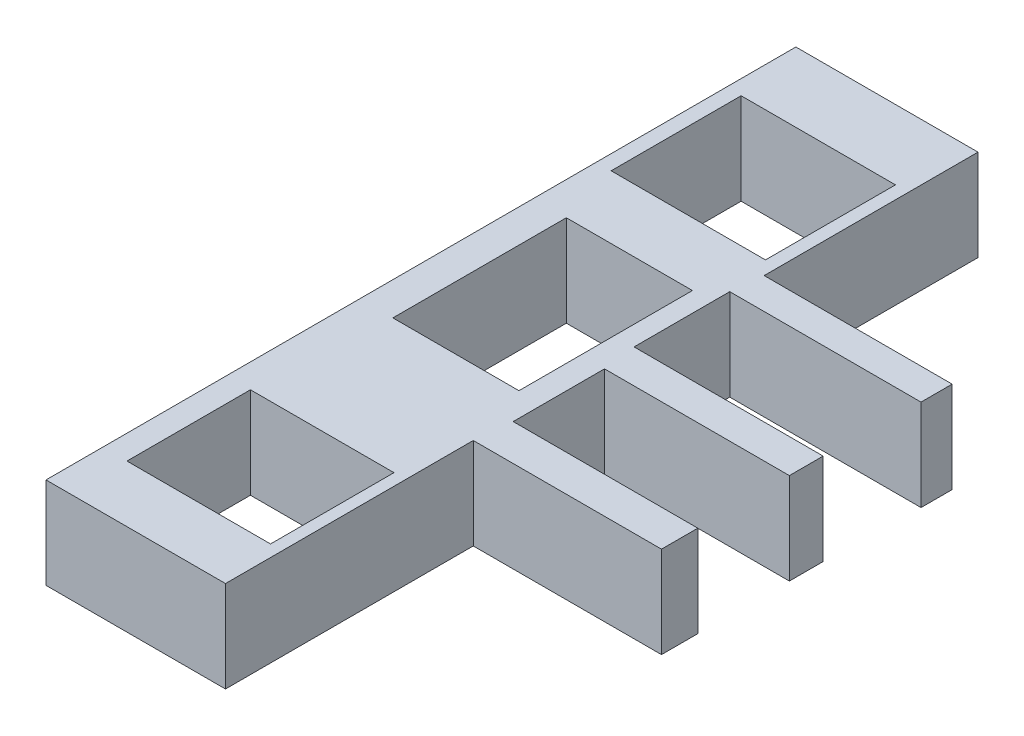
ISO-10303-21;
HEADER;
FILE_DESCRIPTION(('STEP AP214'),'2;1');
FILE_NAME('part.step','',(''),(''),'','','');
FILE_SCHEMA(('AUTOMOTIVE_DESIGN { 1 0 10303 214 1 1 1 1 }'));
ENDSEC;
DATA;
#1=APPLICATION_CONTEXT('core data for automotive mechanical design processes');
#2=APPLICATION_PROTOCOL_DEFINITION('international standard','automotive_design',2000,#1);
#3=PRODUCT_CONTEXT('',#1,'mechanical');
#4=PRODUCT('Part','Part','',(#3));
#5=PRODUCT_RELATED_PRODUCT_CATEGORY('part','',(#4));
#6=PRODUCT_DEFINITION_FORMATION('','',#4);
#7=PRODUCT_DEFINITION_CONTEXT('part definition',#1,'design');
#8=PRODUCT_DEFINITION('design','',#6,#7);
#9=PRODUCT_DEFINITION_SHAPE('','',#8);
#10=(LENGTH_UNIT() NAMED_UNIT(*) SI_UNIT(.MILLI.,.METRE.));
#11=(NAMED_UNIT(*) PLANE_ANGLE_UNIT() SI_UNIT($,.RADIAN.));
#12=(NAMED_UNIT(*) SI_UNIT($,.STERADIAN.) SOLID_ANGLE_UNIT());
#13=UNCERTAINTY_MEASURE_WITH_UNIT(LENGTH_MEASURE(1.E-05),#10,'distance_accuracy_value','');
#14=(GEOMETRIC_REPRESENTATION_CONTEXT(3) GLOBAL_UNCERTAINTY_ASSIGNED_CONTEXT((#13)) GLOBAL_UNIT_ASSIGNED_CONTEXT((#10,
#11,#12)) REPRESENTATION_CONTEXT('',''));
#15=CARTESIAN_POINT('',(0.,0.,0.));
#16=DIRECTION('',(0.,0.,1.));
#17=DIRECTION('',(1.,0.,0.));
#18=AXIS2_PLACEMENT_3D('',#15,#16,#17);
#19=CARTESIAN_POINT('',(0.,14.,0.));
#20=DIRECTION('',(0.,1.,0.));
#21=DIRECTION('',(0.,0.,1.));
#22=AXIS2_PLACEMENT_3D('',#19,#20,#21);
#23=PLANE('',#22);
#24=DIRECTION('',(-1.,0.,0.));
#25=VECTOR('',#24,1.);
#26=CARTESIAN_POINT('',(0.,14.,-57.4835391869948));
#27=LINE('',#26,#25);
#28=CARTESIAN_POINT('',(0.,14.,-57.4835391869948));
#29=VERTEX_POINT('',#28);
#30=CARTESIAN_POINT('',(-27.9085932191344,14.,-57.4835391869948));
#31=VERTEX_POINT('',#30);
#32=EDGE_CURVE('E322',#29,#31,#27,.T.);
#33=ORIENTED_EDGE('',*,*,#32,.T.);
#34=DIRECTION('',(0.,0.,1.));
#35=VECTOR('',#34,1.);
#36=CARTESIAN_POINT('',(-27.9085932191344,14.,-57.4835391869948));
#37=LINE('',#36,#35);
#38=CARTESIAN_POINT('',(-27.9085932191344,14.,57.4248525722049));
#39=VERTEX_POINT('',#38);
#40=EDGE_CURVE('E325',#31,#39,#37,.T.);
#41=ORIENTED_EDGE('',*,*,#40,.T.);
#42=DIRECTION('',(1.,0.,0.));
#43=VECTOR('',#42,1.);
#44=CARTESIAN_POINT('',(-27.9085932191344,14.,57.4248525722049));
#45=LINE('',#44,#43);
#46=CARTESIAN_POINT('',(-0.405302453778081,14.,57.4248525722049));
#47=VERTEX_POINT('',#46);
#48=EDGE_CURVE('E328',#39,#47,#45,.T.);
#49=ORIENTED_EDGE('',*,*,#48,.T.);
#50=DIRECTION('',(0.,0.,-1.));
#51=VECTOR('',#50,1.);
#52=CARTESIAN_POINT('',(-0.405302453778081,14.,57.4248525722049));
#53=LINE('',#52,#51);
#54=CARTESIAN_POINT('',(-0.405302453778082,14.,19.4556514990121));
#55=VERTEX_POINT('',#54);
#56=EDGE_CURVE('E330',#47,#55,#53,.T.);
#57=ORIENTED_EDGE('',*,*,#56,.T.);
#58=DIRECTION('',(1.,0.,0.));
#59=VECTOR('',#58,1.);
#60=CARTESIAN_POINT('',(-0.405302453778082,14.,19.4556514990121));
#61=LINE('',#60,#59);
#62=CARTESIAN_POINT('',(28.4375962048385,14.,19.4556514990121));
#63=VERTEX_POINT('',#62);
#64=EDGE_CURVE('E332',#55,#63,#61,.T.);
#65=ORIENTED_EDGE('',*,*,#64,.T.);
#66=DIRECTION('',(0.,0.,-1.));
#67=VECTOR('',#66,1.);
#68=CARTESIAN_POINT('',(28.4375962048385,14.,19.4556514990121));
#69=LINE('',#68,#67);
#70=CARTESIAN_POINT('',(28.4375962048385,14.,13.8878673342897));
#71=VERTEX_POINT('',#70);
#72=EDGE_CURVE('E334',#63,#71,#69,.T.);
#73=ORIENTED_EDGE('',*,*,#72,.T.);
#74=DIRECTION('',(-1.,0.,0.));
#75=VECTOR('',#74,1.);
#76=CARTESIAN_POINT('',(28.4375962048385,14.,13.8878673342897));
#77=LINE('',#76,#75);
#78=CARTESIAN_POINT('',(0.143608650578303,14.,13.8878673342897));
#79=VERTEX_POINT('',#78);
#80=EDGE_CURVE('E336',#71,#79,#77,.T.);
#81=ORIENTED_EDGE('',*,*,#80,.T.);
#82=DIRECTION('',(0.,0.,-1.));
#83=VECTOR('',#82,1.);
#84=CARTESIAN_POINT('',(0.143608650578303,14.,13.8878673342897));
#85=LINE('',#84,#83);
#86=CARTESIAN_POINT('',(0.143608650578303,14.,-0.105967324756004));
#87=VERTEX_POINT('',#86);
#88=EDGE_CURVE('E338',#79,#87,#85,.T.);
#89=ORIENTED_EDGE('',*,*,#88,.T.);
#90=DIRECTION('',(1.,0.,0.));
#91=VECTOR('',#90,1.);
#92=CARTESIAN_POINT('',(0.143608650578303,14.,-0.105967324756004));
#93=LINE('',#92,#91);
#94=CARTESIAN_POINT('',(28.4721210208394,14.,-0.105967324756004));
#95=VERTEX_POINT('',#94);
#96=EDGE_CURVE('E340',#87,#95,#93,.T.);
#97=ORIENTED_EDGE('',*,*,#96,.T.);
#98=DIRECTION('',(0.,0.,-1.));
#99=VECTOR('',#98,1.);
#100=CARTESIAN_POINT('',(28.4721210208394,14.,-0.105967324756004));
#101=LINE('',#100,#99);
#102=CARTESIAN_POINT('',(28.4721210208394,14.,-5.28253901878225));
#103=VERTEX_POINT('',#102);
#104=EDGE_CURVE('E342',#95,#103,#101,.T.);
#105=ORIENTED_EDGE('',*,*,#104,.T.);
#106=DIRECTION('',(-1.,0.,0.));
#107=VECTOR('',#106,1.);
#108=CARTESIAN_POINT('',(28.4721210208394,14.,-5.28253901878225));
#109=LINE('',#108,#107);
#110=CARTESIAN_POINT('',(-0.501944112113822,14.,-5.28253901878225));
#111=VERTEX_POINT('',#110);
#112=EDGE_CURVE('E344',#103,#111,#109,.T.);
#113=ORIENTED_EDGE('',*,*,#112,.T.);
#114=DIRECTION('',(0.,0.,-1.));
#115=VECTOR('',#114,1.);
#116=CARTESIAN_POINT('',(-0.501944112113822,14.,-5.28253901878225));
#117=LINE('',#116,#115);
#118=CARTESIAN_POINT('',(-0.501944112113822,14.,-19.9459200681226));
#119=VERTEX_POINT('',#118);
#120=EDGE_CURVE('E346',#111,#119,#117,.T.);
#121=ORIENTED_EDGE('',*,*,#120,.T.);
#122=DIRECTION('',(1.,0.,0.));
#123=VECTOR('',#122,1.);
#124=CARTESIAN_POINT('',(-0.501944112113822,14.,-19.9459200681226));
#125=LINE('',#124,#123);
#126=CARTESIAN_POINT('',(28.8074313767948,14.,-19.9459200681226));
#127=VERTEX_POINT('',#126);
#128=EDGE_CURVE('E348',#119,#127,#125,.T.);
#129=ORIENTED_EDGE('',*,*,#128,.T.);
#130=DIRECTION('',(0.,0.,-1.));
#131=VECTOR('',#130,1.);
#132=CARTESIAN_POINT('',(28.8074313767948,14.,-19.9459200681226));
#133=LINE('',#132,#131);
#134=CARTESIAN_POINT('',(28.8074313767948,14.,-24.7164152324675));
#135=VERTEX_POINT('',#134);
#136=EDGE_CURVE('E350',#127,#135,#133,.T.);
#137=ORIENTED_EDGE('',*,*,#136,.T.);
#138=DIRECTION('',(-1.,0.,0.));
#139=VECTOR('',#138,1.);
#140=CARTESIAN_POINT('',(28.8074313767948,14.,-24.7164152324675));
#141=LINE('',#140,#139);
#142=CARTESIAN_POINT('',(0.,14.,-24.7164152324675));
#143=VERTEX_POINT('',#142);
#144=EDGE_CURVE('E352',#135,#143,#141,.T.);
#145=ORIENTED_EDGE('',*,*,#144,.T.);
#146=DIRECTION('',(0.,0.,-1.));
#147=VECTOR('',#146,1.);
#148=CARTESIAN_POINT('',(0.,14.,-24.7164152324675));
#149=LINE('',#148,#147);
#150=EDGE_CURVE('E354',#143,#29,#149,.T.);
#151=ORIENTED_EDGE('',*,*,#150,.T.);
#152=EDGE_LOOP('',(#33,#41,#49,#57,#65,#73,#81,#89,#97,#105,#113,#121,#129,#137,#145,#151));
#153=FACE_BOUND('',#152,.T.);
#154=DIRECTION('',(1.,0.,0.));
#155=VECTOR('',#154,1.);
#156=CARTESIAN_POINT('',(-25.6311184149128,14.,-26.8967287992882));
#157=LINE('',#156,#155);
#158=CARTESIAN_POINT('',(-25.6311184149128,14.,-26.8967287992882));
#159=VERTEX_POINT('',#158);
#160=CARTESIAN_POINT('',(-1.97993480395056,14.,-26.8967287992882));
#161=VERTEX_POINT('',#160);
#162=EDGE_CURVE('E293',#159,#161,#157,.T.);
#163=ORIENTED_EDGE('',*,*,#162,.F.);
#164=DIRECTION('',(0.,0.,1.));
#165=VECTOR('',#164,1.);
#166=CARTESIAN_POINT('',(-25.6311184149128,14.,-26.8967287992882));
#167=LINE('',#166,#165);
#168=CARTESIAN_POINT('',(-25.6311184149128,14.,-46.8170214744367));
#169=VERTEX_POINT('',#168);
#170=EDGE_CURVE('E291',#169,#159,#167,.T.);
#171=ORIENTED_EDGE('',*,*,#170,.F.);
#172=DIRECTION('',(-1.,0.,0.));
#173=VECTOR('',#172,1.);
#174=CARTESIAN_POINT('',(-25.6311184149128,14.,-46.8170214744367));
#175=LINE('',#174,#173);
#176=CARTESIAN_POINT('',(-1.97993480395056,14.,-46.8170214744367));
#177=VERTEX_POINT('',#176);
#178=EDGE_CURVE('E299',#177,#169,#175,.T.);
#179=ORIENTED_EDGE('',*,*,#178,.F.);
#180=DIRECTION('',(0.,0.,-1.));
#181=VECTOR('',#180,1.);
#182=CARTESIAN_POINT('',(-1.97993480395056,14.,-26.8967287992882));
#183=LINE('',#182,#181);
#184=EDGE_CURVE('E296',#161,#177,#183,.T.);
#185=ORIENTED_EDGE('',*,*,#184,.F.);
#186=EDGE_LOOP('',(#163,#171,#179,#185));
#187=FACE_BOUND('',#186,.T.);
#188=DIRECTION('',(1.,0.,0.));
#189=VECTOR('',#188,1.);
#190=CARTESIAN_POINT('',(-22.8329502130525,14.,9.34621172004554));
#191=LINE('',#190,#189);
#192=CARTESIAN_POINT('',(-22.8329502130525,14.,9.34621172004554));
#193=VERTEX_POINT('',#192);
#194=CARTESIAN_POINT('',(-3.5122650097312,14.,9.34621172004554));
#195=VERTEX_POINT('',#194);
#196=EDGE_CURVE('E262',#193,#195,#191,.T.);
#197=ORIENTED_EDGE('',*,*,#196,.F.);
#198=DIRECTION('',(0.,0.,1.));
#199=VECTOR('',#198,1.);
#200=CARTESIAN_POINT('',(-22.8329502130525,14.,-17.2363861976275));
#201=LINE('',#200,#199);
#202=CARTESIAN_POINT('',(-22.8329502130525,14.,-17.2363861976275));
#203=VERTEX_POINT('',#202);
#204=EDGE_CURVE('E260',#203,#193,#201,.T.);
#205=ORIENTED_EDGE('',*,*,#204,.F.);
#206=DIRECTION('',(-1.,0.,0.));
#207=VECTOR('',#206,1.);
#208=CARTESIAN_POINT('',(-22.8329502130525,14.,-17.2363861976275));
#209=LINE('',#208,#207);
#210=CARTESIAN_POINT('',(-3.5122650097312,14.,-17.2363861976275));
#211=VERTEX_POINT('',#210);
#212=EDGE_CURVE('E268',#211,#203,#209,.T.);
#213=ORIENTED_EDGE('',*,*,#212,.F.);
#214=DIRECTION('',(0.,0.,-1.));
#215=VECTOR('',#214,1.);
#216=CARTESIAN_POINT('',(-3.5122650097312,14.,-17.2363861976275));
#217=LINE('',#216,#215);
#218=EDGE_CURVE('E265',#195,#211,#217,.T.);
#219=ORIENTED_EDGE('',*,*,#218,.F.);
#220=EDGE_LOOP('',(#197,#205,#213,#219));
#221=FACE_BOUND('',#220,.T.);
#222=DIRECTION('',(1.,0.,0.));
#223=VECTOR('',#222,1.);
#224=CARTESIAN_POINT('',(-24.2072701944558,14.,48.7204357033658));
#225=LINE('',#224,#223);
#226=CARTESIAN_POINT('',(-24.2072701944558,14.,48.7204357033658));
#227=VERTEX_POINT('',#226);
#228=CARTESIAN_POINT('',(-2.20727019445581,14.,48.7204357033658));
#229=VERTEX_POINT('',#228);
#230=EDGE_CURVE('E232',#227,#229,#225,.T.);
#231=ORIENTED_EDGE('',*,*,#230,.F.);
#232=DIRECTION('',(0.,0.,1.));
#233=VECTOR('',#232,1.);
#234=CARTESIAN_POINT('',(-24.2072701944558,14.,29.799488814596));
#235=LINE('',#234,#233);
#236=CARTESIAN_POINT('',(-24.2072701944558,14.,29.799488814596));
#237=VERTEX_POINT('',#236);
#238=EDGE_CURVE('E224',#237,#227,#235,.T.);
#239=ORIENTED_EDGE('',*,*,#238,.F.);
#240=DIRECTION('',(-1.,0.,0.));
#241=VECTOR('',#240,1.);
#242=CARTESIAN_POINT('',(-24.2072701944558,14.,29.799488814596));
#243=LINE('',#242,#241);
#244=CARTESIAN_POINT('',(-2.20727019445581,14.,29.799488814596));
#245=VERTEX_POINT('',#244);
#246=EDGE_CURVE('E246',#245,#237,#243,.T.);
#247=ORIENTED_EDGE('',*,*,#246,.F.);
#248=DIRECTION('',(0.,0.,-1.));
#249=VECTOR('',#248,1.);
#250=CARTESIAN_POINT('',(-2.20727019445581,14.,29.799488814596));
#251=LINE('',#250,#249);
#252=EDGE_CURVE('E244',#229,#245,#251,.T.);
#253=ORIENTED_EDGE('',*,*,#252,.F.);
#254=EDGE_LOOP('',(#231,#239,#247,#253));
#255=FACE_BOUND('',#254,.T.);
#256=ADVANCED_FACE('F39',(#153,#187,#221,#255),#23,.T.);
#257=CARTESIAN_POINT('',(0.,0.,0.));
#258=DIRECTION('',(0.,1.,0.));
#259=DIRECTION('',(0.,0.,1.));
#260=AXIS2_PLACEMENT_3D('',#257,#258,#259);
#261=PLANE('',#260);
#262=DIRECTION('',(0.,0.,1.));
#263=VECTOR('',#262,1.);
#264=CARTESIAN_POINT('',(-22.8329502130525,0.,-17.2363861976275));
#265=LINE('',#264,#263);
#266=CARTESIAN_POINT('',(-22.8329502130525,0.,-17.2363861976275));
#267=VERTEX_POINT('',#266);
#268=CARTESIAN_POINT('',(-22.8329502130525,0.,9.34621172004554));
#269=VERTEX_POINT('',#268);
#270=EDGE_CURVE('E240',#267,#269,#265,.T.);
#271=ORIENTED_EDGE('',*,*,#270,.T.);
#272=DIRECTION('',(1.,0.,0.));
#273=VECTOR('',#272,1.);
#274=CARTESIAN_POINT('',(-22.8329502130525,0.,9.34621172004554));
#275=LINE('',#274,#273);
#276=CARTESIAN_POINT('',(-3.5122650097312,0.,9.34621172004554));
#277=VERTEX_POINT('',#276);
#278=EDGE_CURVE('E273',#269,#277,#275,.T.);
#279=ORIENTED_EDGE('',*,*,#278,.T.);
#280=DIRECTION('',(0.,0.,-1.));
#281=VECTOR('',#280,1.);
#282=CARTESIAN_POINT('',(-3.5122650097312,0.,-17.2363861976275));
#283=LINE('',#282,#281);
#284=CARTESIAN_POINT('',(-3.5122650097312,0.,-17.2363861976275));
#285=VERTEX_POINT('',#284);
#286=EDGE_CURVE('E276',#277,#285,#283,.T.);
#287=ORIENTED_EDGE('',*,*,#286,.T.);
#288=DIRECTION('',(-1.,0.,0.));
#289=VECTOR('',#288,1.);
#290=CARTESIAN_POINT('',(-22.8329502130525,0.,-17.2363861976275));
#291=LINE('',#290,#289);
#292=EDGE_CURVE('E263',#285,#267,#291,.T.);
#293=ORIENTED_EDGE('',*,*,#292,.T.);
#294=EDGE_LOOP('',(#271,#279,#287,#293));
#295=FACE_BOUND('',#294,.T.);
#296=DIRECTION('',(-1.,0.,0.));
#297=VECTOR('',#296,1.);
#298=CARTESIAN_POINT('',(0.,0.,-57.4835391869948));
#299=LINE('',#298,#297);
#300=CARTESIAN_POINT('',(0.,0.,-57.4835391869948));
#301=VERTEX_POINT('',#300);
#302=CARTESIAN_POINT('',(-27.9085932191344,0.,-57.4835391869948));
#303=VERTEX_POINT('',#302);
#304=EDGE_CURVE('E321',#301,#303,#299,.T.);
#305=ORIENTED_EDGE('',*,*,#304,.F.);
#306=DIRECTION('',(0.,0.,-1.));
#307=VECTOR('',#306,1.);
#308=CARTESIAN_POINT('',(0.,0.,-24.7164152324675));
#309=LINE('',#308,#307);
#310=CARTESIAN_POINT('',(0.,0.,-24.7164152324675));
#311=VERTEX_POINT('',#310);
#312=EDGE_CURVE('E326',#311,#301,#309,.T.);
#313=ORIENTED_EDGE('',*,*,#312,.F.);
#314=DIRECTION('',(-1.,0.,0.));
#315=VECTOR('',#314,1.);
#316=CARTESIAN_POINT('',(28.8074313767948,0.,-24.7164152324675));
#317=LINE('',#316,#315);
#318=CARTESIAN_POINT('',(28.8074313767948,0.,-24.7164152324675));
#319=VERTEX_POINT('',#318);
#320=EDGE_CURVE('E385',#319,#311,#317,.T.);
#321=ORIENTED_EDGE('',*,*,#320,.F.);
#322=DIRECTION('',(0.,0.,-1.));
#323=VECTOR('',#322,1.);
#324=CARTESIAN_POINT('',(28.8074313767948,0.,-19.9459200681226));
#325=LINE('',#324,#323);
#326=CARTESIAN_POINT('',(28.8074313767948,0.,-19.9459200681226));
#327=VERTEX_POINT('',#326);
#328=EDGE_CURVE('E383',#327,#319,#325,.T.);
#329=ORIENTED_EDGE('',*,*,#328,.F.);
#330=DIRECTION('',(1.,0.,0.));
#331=VECTOR('',#330,1.);
#332=CARTESIAN_POINT('',(-0.501944112113822,0.,-19.9459200681226));
#333=LINE('',#332,#331);
#334=CARTESIAN_POINT('',(-0.501944112113822,0.,-19.9459200681226));
#335=VERTEX_POINT('',#334);
#336=EDGE_CURVE('E381',#335,#327,#333,.T.);
#337=ORIENTED_EDGE('',*,*,#336,.F.);
#338=DIRECTION('',(0.,0.,-1.));
#339=VECTOR('',#338,1.);
#340=CARTESIAN_POINT('',(-0.501944112113822,0.,-5.28253901878225));
#341=LINE('',#340,#339);
#342=CARTESIAN_POINT('',(-0.501944112113822,0.,-5.28253901878225));
#343=VERTEX_POINT('',#342);
#344=EDGE_CURVE('E379',#343,#335,#341,.T.);
#345=ORIENTED_EDGE('',*,*,#344,.F.);
#346=DIRECTION('',(-1.,0.,0.));
#347=VECTOR('',#346,1.);
#348=CARTESIAN_POINT('',(28.4721210208394,0.,-5.28253901878225));
#349=LINE('',#348,#347);
#350=CARTESIAN_POINT('',(28.4721210208394,0.,-5.28253901878225));
#351=VERTEX_POINT('',#350);
#352=EDGE_CURVE('E377',#351,#343,#349,.T.);
#353=ORIENTED_EDGE('',*,*,#352,.F.);
#354=DIRECTION('',(0.,0.,-1.));
#355=VECTOR('',#354,1.);
#356=CARTESIAN_POINT('',(28.4721210208394,0.,-0.105967324756004));
#357=LINE('',#356,#355);
#358=CARTESIAN_POINT('',(28.4721210208394,0.,-0.105967324756004));
#359=VERTEX_POINT('',#358);
#360=EDGE_CURVE('E375',#359,#351,#357,.T.);
#361=ORIENTED_EDGE('',*,*,#360,.F.);
#362=DIRECTION('',(1.,0.,0.));
#363=VECTOR('',#362,1.);
#364=CARTESIAN_POINT('',(0.143608650578303,0.,-0.105967324756004));
#365=LINE('',#364,#363);
#366=CARTESIAN_POINT('',(0.143608650578303,0.,-0.105967324756004));
#367=VERTEX_POINT('',#366);
#368=EDGE_CURVE('E373',#367,#359,#365,.T.);
#369=ORIENTED_EDGE('',*,*,#368,.F.);
#370=DIRECTION('',(0.,0.,-1.));
#371=VECTOR('',#370,1.);
#372=CARTESIAN_POINT('',(0.143608650578303,0.,13.8878673342897));
#373=LINE('',#372,#371);
#374=CARTESIAN_POINT('',(0.143608650578303,0.,13.8878673342897));
#375=VERTEX_POINT('',#374);
#376=EDGE_CURVE('E371',#375,#367,#373,.T.);
#377=ORIENTED_EDGE('',*,*,#376,.F.);
#378=DIRECTION('',(-1.,0.,0.));
#379=VECTOR('',#378,1.);
#380=CARTESIAN_POINT('',(28.4375962048385,0.,13.8878673342897));
#381=LINE('',#380,#379);
#382=CARTESIAN_POINT('',(28.4375962048385,0.,13.8878673342897));
#383=VERTEX_POINT('',#382);
#384=EDGE_CURVE('E369',#383,#375,#381,.T.);
#385=ORIENTED_EDGE('',*,*,#384,.F.);
#386=DIRECTION('',(0.,0.,-1.));
#387=VECTOR('',#386,1.);
#388=CARTESIAN_POINT('',(28.4375962048385,0.,19.4556514990121));
#389=LINE('',#388,#387);
#390=CARTESIAN_POINT('',(28.4375962048385,0.,19.4556514990121));
#391=VERTEX_POINT('',#390);
#392=EDGE_CURVE('E367',#391,#383,#389,.T.);
#393=ORIENTED_EDGE('',*,*,#392,.F.);
#394=DIRECTION('',(1.,0.,0.));
#395=VECTOR('',#394,1.);
#396=CARTESIAN_POINT('',(-0.405302453778082,0.,19.4556514990121));
#397=LINE('',#396,#395);
#398=CARTESIAN_POINT('',(-0.405302453778082,0.,19.4556514990121));
#399=VERTEX_POINT('',#398);
#400=EDGE_CURVE('E365',#399,#391,#397,.T.);
#401=ORIENTED_EDGE('',*,*,#400,.F.);
#402=DIRECTION('',(0.,0.,-1.));
#403=VECTOR('',#402,1.);
#404=CARTESIAN_POINT('',(-0.405302453778081,0.,57.4248525722049));
#405=LINE('',#404,#403);
#406=CARTESIAN_POINT('',(-0.405302453778081,0.,57.4248525722049));
#407=VERTEX_POINT('',#406);
#408=EDGE_CURVE('E363',#407,#399,#405,.T.);
#409=ORIENTED_EDGE('',*,*,#408,.F.);
#410=DIRECTION('',(1.,0.,0.));
#411=VECTOR('',#410,1.);
#412=CARTESIAN_POINT('',(-27.9085932191344,0.,57.4248525722049));
#413=LINE('',#412,#411);
#414=CARTESIAN_POINT('',(-27.9085932191344,0.,57.4248525722049));
#415=VERTEX_POINT('',#414);
#416=EDGE_CURVE('E361',#415,#407,#413,.T.);
#417=ORIENTED_EDGE('',*,*,#416,.F.);
#418=DIRECTION('',(0.,0.,1.));
#419=VECTOR('',#418,1.);
#420=CARTESIAN_POINT('',(-27.9085932191344,0.,-57.4835391869948));
#421=LINE('',#420,#419);
#422=EDGE_CURVE('E359',#303,#415,#421,.T.);
#423=ORIENTED_EDGE('',*,*,#422,.F.);
#424=EDGE_LOOP('',(#305,#313,#321,#329,#337,#345,#353,#361,#369,#377,#385,#393,#401,#409,#417,#423));
#425=FACE_BOUND('',#424,.T.);
#426=DIRECTION('',(0.,0.,1.));
#427=VECTOR('',#426,1.);
#428=CARTESIAN_POINT('',(-25.6311184149128,0.,-26.8967287992882));
#429=LINE('',#428,#427);
#430=CARTESIAN_POINT('',(-25.6311184149128,0.,-46.8170214744367));
#431=VERTEX_POINT('',#430);
#432=CARTESIAN_POINT('',(-25.6311184149128,0.,-26.8967287992882));
#433=VERTEX_POINT('',#432);
#434=EDGE_CURVE('E290',#431,#433,#429,.T.);
#435=ORIENTED_EDGE('',*,*,#434,.T.);
#436=DIRECTION('',(1.,0.,0.));
#437=VECTOR('',#436,1.);
#438=CARTESIAN_POINT('',(-25.6311184149128,0.,-26.8967287992882));
#439=LINE('',#438,#437);
#440=CARTESIAN_POINT('',(-1.97993480395056,0.,-26.8967287992882));
#441=VERTEX_POINT('',#440);
#442=EDGE_CURVE('E304',#433,#441,#439,.T.);
#443=ORIENTED_EDGE('',*,*,#442,.T.);
#444=DIRECTION('',(0.,0.,-1.));
#445=VECTOR('',#444,1.);
#446=CARTESIAN_POINT('',(-1.97993480395056,0.,-26.8967287992882));
#447=LINE('',#446,#445);
#448=CARTESIAN_POINT('',(-1.97993480395056,0.,-46.8170214744367));
#449=VERTEX_POINT('',#448);
#450=EDGE_CURVE('E307',#441,#449,#447,.T.);
#451=ORIENTED_EDGE('',*,*,#450,.T.);
#452=DIRECTION('',(-1.,0.,0.));
#453=VECTOR('',#452,1.);
#454=CARTESIAN_POINT('',(-25.6311184149128,0.,-46.8170214744367));
#455=LINE('',#454,#453);
#456=EDGE_CURVE('E294',#449,#431,#455,.T.);
#457=ORIENTED_EDGE('',*,*,#456,.T.);
#458=EDGE_LOOP('',(#435,#443,#451,#457));
#459=FACE_BOUND('',#458,.T.);
#460=DIRECTION('',(0.,0.,1.));
#461=VECTOR('',#460,1.);
#462=CARTESIAN_POINT('',(-24.2072701944558,0.,29.799488814596));
#463=LINE('',#462,#461);
#464=CARTESIAN_POINT('',(-24.2072701944558,0.,29.799488814596));
#465=VERTEX_POINT('',#464);
#466=CARTESIAN_POINT('',(-24.2072701944558,0.,48.7204357033658));
#467=VERTEX_POINT('',#466);
#468=EDGE_CURVE('E62',#465,#467,#463,.T.);
#469=ORIENTED_EDGE('',*,*,#468,.T.);
#470=DIRECTION('',(1.,0.,0.));
#471=VECTOR('',#470,1.);
#472=CARTESIAN_POINT('',(-24.2072701944558,0.,48.7204357033658));
#473=LINE('',#472,#471);
#474=CARTESIAN_POINT('',(-2.20727019445581,0.,48.7204357033658));
#475=VERTEX_POINT('',#474);
#476=EDGE_CURVE('E239',#467,#475,#473,.T.);
#477=ORIENTED_EDGE('',*,*,#476,.T.);
#478=DIRECTION('',(0.,0.,-1.));
#479=VECTOR('',#478,1.);
#480=CARTESIAN_POINT('',(-2.20727019445581,0.,29.799488814596));
#481=LINE('',#480,#479);
#482=CARTESIAN_POINT('',(-2.20727019445581,0.,29.799488814596));
#483=VERTEX_POINT('',#482);
#484=EDGE_CURVE('E252',#475,#483,#481,.T.);
#485=ORIENTED_EDGE('',*,*,#484,.T.);
#486=DIRECTION('',(-1.,0.,0.));
#487=VECTOR('',#486,1.);
#488=CARTESIAN_POINT('',(-24.2072701944558,0.,29.799488814596));
#489=LINE('',#488,#487);
#490=EDGE_CURVE('E233',#483,#465,#489,.T.);
#491=ORIENTED_EDGE('',*,*,#490,.T.);
#492=EDGE_LOOP('',(#469,#477,#485,#491));
#493=FACE_BOUND('',#492,.T.);
#494=ADVANCED_FACE('F439',(#295,#425,#459,#493),#261,.F.);
#495=CARTESIAN_POINT('',(0.,14.,-57.4835391869948));
#496=DIRECTION('',(0.,0.,1.));
#497=DIRECTION('',(1.,0.,0.));
#498=AXIS2_PLACEMENT_3D('',#495,#496,#497);
#499=PLANE('',#498);
#500=ORIENTED_EDGE('',*,*,#304,.T.);
#501=DIRECTION('',(0.,-1.,0.));
#502=VECTOR('',#501,1.);
#503=CARTESIAN_POINT('',(-27.9085932191344,14.,-57.4835391869948));
#504=LINE('',#503,#502);
#505=EDGE_CURVE('E11',#31,#303,#504,.T.);
#506=ORIENTED_EDGE('',*,*,#505,.F.);
#507=ORIENTED_EDGE('',*,*,#32,.F.);
#508=DIRECTION('',(0.,-1.,0.));
#509=VECTOR('',#508,1.);
#510=CARTESIAN_POINT('',(0.,14.,-57.4835391869948));
#511=LINE('',#510,#509);
#512=EDGE_CURVE('E356',#29,#301,#511,.T.);
#513=ORIENTED_EDGE('',*,*,#512,.T.);
#514=EDGE_LOOP('',(#500,#506,#507,#513));
#515=FACE_BOUND('',#514,.T.);
#516=ADVANCED_FACE('F41',(#515),#499,.F.);
#517=CARTESIAN_POINT('',(-27.9085932191344,14.,-57.4835391869948));
#518=DIRECTION('',(1.,0.,0.));
#519=DIRECTION('',(0.,0.,-1.));
#520=AXIS2_PLACEMENT_3D('',#517,#518,#519);
#521=PLANE('',#520);
#522=ORIENTED_EDGE('',*,*,#422,.T.);
#523=DIRECTION('',(0.,-1.,0.));
#524=VECTOR('',#523,1.);
#525=CARTESIAN_POINT('',(-27.9085932191344,14.,57.4248525722049));
#526=LINE('',#525,#524);
#527=EDGE_CURVE('E47',#39,#415,#526,.T.);
#528=ORIENTED_EDGE('',*,*,#527,.F.);
#529=ORIENTED_EDGE('',*,*,#40,.F.);
#530=ORIENTED_EDGE('',*,*,#505,.T.);
#531=EDGE_LOOP('',(#522,#528,#529,#530));
#532=FACE_BOUND('',#531,.T.);
#533=ADVANCED_FACE('F457',(#532),#521,.F.);
#534=CARTESIAN_POINT('',(-27.9085932191344,14.,57.4248525722049));
#535=DIRECTION('',(0.,0.,-1.));
#536=DIRECTION('',(-1.,0.,0.));
#537=AXIS2_PLACEMENT_3D('',#534,#535,#536);
#538=PLANE('',#537);
#539=ORIENTED_EDGE('',*,*,#416,.T.);
#540=DIRECTION('',(0.,-1.,0.));
#541=VECTOR('',#540,1.);
#542=CARTESIAN_POINT('',(-0.405302453778081,14.,57.4248525722049));
#543=LINE('',#542,#541);
#544=EDGE_CURVE('E426',#47,#407,#543,.T.);
#545=ORIENTED_EDGE('',*,*,#544,.F.);
#546=ORIENTED_EDGE('',*,*,#48,.F.);
#547=ORIENTED_EDGE('',*,*,#527,.T.);
#548=EDGE_LOOP('',(#539,#545,#546,#547));
#549=FACE_BOUND('',#548,.T.);
#550=ADVANCED_FACE('F433',(#549),#538,.F.);
#551=CARTESIAN_POINT('',(-0.405302453778081,14.,57.4248525722049));
#552=DIRECTION('',(-1.,0.,0.));
#553=DIRECTION('',(0.,0.,1.));
#554=AXIS2_PLACEMENT_3D('',#551,#552,#553);
#555=PLANE('',#554);
#556=ORIENTED_EDGE('',*,*,#408,.T.);
#557=DIRECTION('',(0.,-1.,0.));
#558=VECTOR('',#557,1.);
#559=CARTESIAN_POINT('',(-0.405302453778082,14.,19.4556514990121));
#560=LINE('',#559,#558);
#561=EDGE_CURVE('E423',#55,#399,#560,.T.);
#562=ORIENTED_EDGE('',*,*,#561,.F.);
#563=ORIENTED_EDGE('',*,*,#56,.F.);
#564=ORIENTED_EDGE('',*,*,#544,.T.);
#565=EDGE_LOOP('',(#556,#562,#563,#564));
#566=FACE_BOUND('',#565,.T.);
#567=ADVANCED_FACE('F445',(#566),#555,.F.);
#568=CARTESIAN_POINT('',(-0.405302453778082,14.,19.4556514990121));
#569=DIRECTION('',(0.,0.,-1.));
#570=DIRECTION('',(-1.,0.,0.));
#571=AXIS2_PLACEMENT_3D('',#568,#569,#570);
#572=PLANE('',#571);
#573=ORIENTED_EDGE('',*,*,#400,.T.);
#574=DIRECTION('',(0.,-1.,0.));
#575=VECTOR('',#574,1.);
#576=CARTESIAN_POINT('',(28.4375962048385,14.,19.4556514990121));
#577=LINE('',#576,#575);
#578=EDGE_CURVE('E420',#63,#391,#577,.T.);
#579=ORIENTED_EDGE('',*,*,#578,.F.);
#580=ORIENTED_EDGE('',*,*,#64,.F.);
#581=ORIENTED_EDGE('',*,*,#561,.T.);
#582=EDGE_LOOP('',(#573,#579,#580,#581));
#583=FACE_BOUND('',#582,.T.);
#584=ADVANCED_FACE('F449',(#583),#572,.F.);
#585=CARTESIAN_POINT('',(28.4375962048385,14.,19.4556514990121));
#586=DIRECTION('',(-1.,0.,0.));
#587=DIRECTION('',(0.,0.,1.));
#588=AXIS2_PLACEMENT_3D('',#585,#586,#587);
#589=PLANE('',#588);
#590=ORIENTED_EDGE('',*,*,#392,.T.);
#591=DIRECTION('',(0.,-1.,0.));
#592=VECTOR('',#591,1.);
#593=CARTESIAN_POINT('',(28.4375962048385,14.,13.8878673342897));
#594=LINE('',#593,#592);
#595=EDGE_CURVE('E417',#71,#383,#594,.T.);
#596=ORIENTED_EDGE('',*,*,#595,.F.);
#597=ORIENTED_EDGE('',*,*,#72,.F.);
#598=ORIENTED_EDGE('',*,*,#578,.T.);
#599=EDGE_LOOP('',(#590,#596,#597,#598));
#600=FACE_BOUND('',#599,.T.);
#601=ADVANCED_FACE('F510',(#600),#589,.F.);
#602=CARTESIAN_POINT('',(28.4375962048385,14.,13.8878673342897));
#603=DIRECTION('',(0.,0.,1.));
#604=DIRECTION('',(1.,0.,0.));
#605=AXIS2_PLACEMENT_3D('',#602,#603,#604);
#606=PLANE('',#605);
#607=ORIENTED_EDGE('',*,*,#384,.T.);
#608=DIRECTION('',(0.,-1.,0.));
#609=VECTOR('',#608,1.);
#610=CARTESIAN_POINT('',(0.143608650578303,14.,13.8878673342897));
#611=LINE('',#610,#609);
#612=EDGE_CURVE('E414',#79,#375,#611,.T.);
#613=ORIENTED_EDGE('',*,*,#612,.F.);
#614=ORIENTED_EDGE('',*,*,#80,.F.);
#615=ORIENTED_EDGE('',*,*,#595,.T.);
#616=EDGE_LOOP('',(#607,#613,#614,#615));
#617=FACE_BOUND('',#616,.T.);
#618=ADVANCED_FACE('F507',(#617),#606,.F.);
#619=CARTESIAN_POINT('',(0.143608650578303,14.,13.8878673342897));
#620=DIRECTION('',(-1.,0.,0.));
#621=DIRECTION('',(0.,0.,1.));
#622=AXIS2_PLACEMENT_3D('',#619,#620,#621);
#623=PLANE('',#622);
#624=ORIENTED_EDGE('',*,*,#376,.T.);
#625=DIRECTION('',(0.,-1.,0.));
#626=VECTOR('',#625,1.);
#627=CARTESIAN_POINT('',(0.143608650578303,14.,-0.105967324756004));
#628=LINE('',#627,#626);
#629=EDGE_CURVE('E411',#87,#367,#628,.T.);
#630=ORIENTED_EDGE('',*,*,#629,.F.);
#631=ORIENTED_EDGE('',*,*,#88,.F.);
#632=ORIENTED_EDGE('',*,*,#612,.T.);
#633=EDGE_LOOP('',(#624,#630,#631,#632));
#634=FACE_BOUND('',#633,.T.);
#635=ADVANCED_FACE('F503',(#634),#623,.F.);
#636=CARTESIAN_POINT('',(0.143608650578303,14.,-0.105967324756004));
#637=DIRECTION('',(0.,0.,-1.));
#638=DIRECTION('',(-1.,0.,0.));
#639=AXIS2_PLACEMENT_3D('',#636,#637,#638);
#640=PLANE('',#639);
#641=ORIENTED_EDGE('',*,*,#368,.T.);
#642=DIRECTION('',(0.,-1.,0.));
#643=VECTOR('',#642,1.);
#644=CARTESIAN_POINT('',(28.4721210208394,14.,-0.105967324756004));
#645=LINE('',#644,#643);
#646=EDGE_CURVE('E408',#95,#359,#645,.T.);
#647=ORIENTED_EDGE('',*,*,#646,.F.);
#648=ORIENTED_EDGE('',*,*,#96,.F.);
#649=ORIENTED_EDGE('',*,*,#629,.T.);
#650=EDGE_LOOP('',(#641,#647,#648,#649));
#651=FACE_BOUND('',#650,.T.);
#652=ADVANCED_FACE('F499',(#651),#640,.F.);
#653=CARTESIAN_POINT('',(28.4721210208394,14.,-0.105967324756004));
#654=DIRECTION('',(-1.,0.,0.));
#655=DIRECTION('',(0.,0.,1.));
#656=AXIS2_PLACEMENT_3D('',#653,#654,#655);
#657=PLANE('',#656);
#658=ORIENTED_EDGE('',*,*,#360,.T.);
#659=DIRECTION('',(0.,-1.,0.));
#660=VECTOR('',#659,1.);
#661=CARTESIAN_POINT('',(28.4721210208394,14.,-5.28253901878225));
#662=LINE('',#661,#660);
#663=EDGE_CURVE('E405',#103,#351,#662,.T.);
#664=ORIENTED_EDGE('',*,*,#663,.F.);
#665=ORIENTED_EDGE('',*,*,#104,.F.);
#666=ORIENTED_EDGE('',*,*,#646,.T.);
#667=EDGE_LOOP('',(#658,#664,#665,#666));
#668=FACE_BOUND('',#667,.T.);
#669=ADVANCED_FACE('F494',(#668),#657,.F.);
#670=CARTESIAN_POINT('',(28.4721210208394,14.,-5.28253901878225));
#671=DIRECTION('',(0.,0.,1.));
#672=DIRECTION('',(1.,0.,0.));
#673=AXIS2_PLACEMENT_3D('',#670,#671,#672);
#674=PLANE('',#673);
#675=ORIENTED_EDGE('',*,*,#352,.T.);
#676=DIRECTION('',(0.,-1.,0.));
#677=VECTOR('',#676,1.);
#678=CARTESIAN_POINT('',(-0.501944112113822,14.,-5.28253901878225));
#679=LINE('',#678,#677);
#680=EDGE_CURVE('E402',#111,#343,#679,.T.);
#681=ORIENTED_EDGE('',*,*,#680,.F.);
#682=ORIENTED_EDGE('',*,*,#112,.F.);
#683=ORIENTED_EDGE('',*,*,#663,.T.);
#684=EDGE_LOOP('',(#675,#681,#682,#683));
#685=FACE_BOUND('',#684,.T.);
#686=ADVANCED_FACE('F488',(#685),#674,.F.);
#687=CARTESIAN_POINT('',(-0.501944112113822,14.,-5.28253901878225));
#688=DIRECTION('',(-1.,0.,0.));
#689=DIRECTION('',(0.,0.,1.));
#690=AXIS2_PLACEMENT_3D('',#687,#688,#689);
#691=PLANE('',#690);
#692=ORIENTED_EDGE('',*,*,#344,.T.);
#693=DIRECTION('',(0.,-1.,0.));
#694=VECTOR('',#693,1.);
#695=CARTESIAN_POINT('',(-0.501944112113822,14.,-19.9459200681226));
#696=LINE('',#695,#694);
#697=EDGE_CURVE('E399',#119,#335,#696,.T.);
#698=ORIENTED_EDGE('',*,*,#697,.F.);
#699=ORIENTED_EDGE('',*,*,#120,.F.);
#700=ORIENTED_EDGE('',*,*,#680,.T.);
#701=EDGE_LOOP('',(#692,#698,#699,#700));
#702=FACE_BOUND('',#701,.T.);
#703=ADVANCED_FACE('F484',(#702),#691,.F.);
#704=CARTESIAN_POINT('',(-0.501944112113822,14.,-19.9459200681226));
#705=DIRECTION('',(0.,0.,-1.));
#706=DIRECTION('',(-1.,0.,0.));
#707=AXIS2_PLACEMENT_3D('',#704,#705,#706);
#708=PLANE('',#707);
#709=ORIENTED_EDGE('',*,*,#336,.T.);
#710=DIRECTION('',(0.,-1.,0.));
#711=VECTOR('',#710,1.);
#712=CARTESIAN_POINT('',(28.8074313767948,14.,-19.9459200681226));
#713=LINE('',#712,#711);
#714=EDGE_CURVE('E396',#127,#327,#713,.T.);
#715=ORIENTED_EDGE('',*,*,#714,.F.);
#716=ORIENTED_EDGE('',*,*,#128,.F.);
#717=ORIENTED_EDGE('',*,*,#697,.T.);
#718=EDGE_LOOP('',(#709,#715,#716,#717));
#719=FACE_BOUND('',#718,.T.);
#720=ADVANCED_FACE('F479',(#719),#708,.F.);
#721=CARTESIAN_POINT('',(28.8074313767948,14.,-19.9459200681226));
#722=DIRECTION('',(-1.,0.,0.));
#723=DIRECTION('',(0.,0.,1.));
#724=AXIS2_PLACEMENT_3D('',#721,#722,#723);
#725=PLANE('',#724);
#726=ORIENTED_EDGE('',*,*,#328,.T.);
#727=DIRECTION('',(0.,-1.,0.));
#728=VECTOR('',#727,1.);
#729=CARTESIAN_POINT('',(28.8074313767948,14.,-24.7164152324675));
#730=LINE('',#729,#728);
#731=EDGE_CURVE('E393',#135,#319,#730,.T.);
#732=ORIENTED_EDGE('',*,*,#731,.F.);
#733=ORIENTED_EDGE('',*,*,#136,.F.);
#734=ORIENTED_EDGE('',*,*,#714,.T.);
#735=EDGE_LOOP('',(#726,#732,#733,#734));
#736=FACE_BOUND('',#735,.T.);
#737=ADVANCED_FACE('F473',(#736),#725,.F.);
#738=CARTESIAN_POINT('',(28.8074313767948,14.,-24.7164152324675));
#739=DIRECTION('',(0.,0.,1.));
#740=DIRECTION('',(1.,0.,0.));
#741=AXIS2_PLACEMENT_3D('',#738,#739,#740);
#742=PLANE('',#741);
#743=ORIENTED_EDGE('',*,*,#320,.T.);
#744=DIRECTION('',(0.,-1.,0.));
#745=VECTOR('',#744,1.);
#746=CARTESIAN_POINT('',(0.,14.,-24.7164152324675));
#747=LINE('',#746,#745);
#748=EDGE_CURVE('E390',#143,#311,#747,.T.);
#749=ORIENTED_EDGE('',*,*,#748,.F.);
#750=ORIENTED_EDGE('',*,*,#144,.F.);
#751=ORIENTED_EDGE('',*,*,#731,.T.);
#752=EDGE_LOOP('',(#743,#749,#750,#751));
#753=FACE_BOUND('',#752,.T.);
#754=ADVANCED_FACE('F469',(#753),#742,.F.);
#755=CARTESIAN_POINT('',(0.,14.,-24.7164152324675));
#756=DIRECTION('',(-1.,0.,0.));
#757=DIRECTION('',(0.,0.,1.));
#758=AXIS2_PLACEMENT_3D('',#755,#756,#757);
#759=PLANE('',#758);
#760=ORIENTED_EDGE('',*,*,#312,.T.);
#761=ORIENTED_EDGE('',*,*,#512,.F.);
#762=ORIENTED_EDGE('',*,*,#150,.F.);
#763=ORIENTED_EDGE('',*,*,#748,.T.);
#764=EDGE_LOOP('',(#760,#761,#762,#763));
#765=FACE_BOUND('',#764,.T.);
#766=ADVANCED_FACE('F464',(#765),#759,.F.);
#767=CARTESIAN_POINT('',(-25.6311184149128,14.,-26.8967287992882));
#768=DIRECTION('',(1.,0.,0.));
#769=DIRECTION('',(0.,0.,-1.));
#770=AXIS2_PLACEMENT_3D('',#767,#768,#769);
#771=PLANE('',#770);
#772=ORIENTED_EDGE('',*,*,#434,.F.);
#773=DIRECTION('',(0.,-1.,0.));
#774=VECTOR('',#773,1.);
#775=CARTESIAN_POINT('',(-25.6311184149128,14.,-46.8170214744367));
#776=LINE('',#775,#774);
#777=EDGE_CURVE('E301',#169,#431,#776,.T.);
#778=ORIENTED_EDGE('',*,*,#777,.F.);
#779=ORIENTED_EDGE('',*,*,#170,.T.);
#780=DIRECTION('',(0.,-1.,0.));
#781=VECTOR('',#780,1.);
#782=CARTESIAN_POINT('',(-25.6311184149128,14.,-26.8967287992882));
#783=LINE('',#782,#781);
#784=EDGE_CURVE('E318',#159,#433,#783,.T.);
#785=ORIENTED_EDGE('',*,*,#784,.T.);
#786=EDGE_LOOP('',(#772,#778,#779,#785));
#787=FACE_BOUND('',#786,.T.);
#788=ADVANCED_FACE('F527',(#787),#771,.T.);
#789=CARTESIAN_POINT('',(-25.6311184149128,14.,-26.8967287992882));
#790=DIRECTION('',(0.,0.,-1.));
#791=DIRECTION('',(-1.,0.,0.));
#792=AXIS2_PLACEMENT_3D('',#789,#790,#791);
#793=PLANE('',#792);
#794=ORIENTED_EDGE('',*,*,#442,.F.);
#795=ORIENTED_EDGE('',*,*,#784,.F.);
#796=ORIENTED_EDGE('',*,*,#162,.T.);
#797=DIRECTION('',(0.,-1.,0.));
#798=VECTOR('',#797,1.);
#799=CARTESIAN_POINT('',(-1.97993480395056,14.,-26.8967287992882));
#800=LINE('',#799,#798);
#801=EDGE_CURVE('E316',#161,#441,#800,.T.);
#802=ORIENTED_EDGE('',*,*,#801,.T.);
#803=EDGE_LOOP('',(#794,#795,#796,#802));
#804=FACE_BOUND('',#803,.T.);
#805=ADVANCED_FACE('F598',(#804),#793,.T.);
#806=CARTESIAN_POINT('',(-1.97993480395056,14.,-26.8967287992882));
#807=DIRECTION('',(-1.,0.,0.));
#808=DIRECTION('',(0.,0.,1.));
#809=AXIS2_PLACEMENT_3D('',#806,#807,#808);
#810=PLANE('',#809);
#811=ORIENTED_EDGE('',*,*,#450,.F.);
#812=ORIENTED_EDGE('',*,*,#801,.F.);
#813=ORIENTED_EDGE('',*,*,#184,.T.);
#814=DIRECTION('',(0.,-1.,0.));
#815=VECTOR('',#814,1.);
#816=CARTESIAN_POINT('',(-1.97993480395056,14.,-46.8170214744367));
#817=LINE('',#816,#815);
#818=EDGE_CURVE('E314',#177,#449,#817,.T.);
#819=ORIENTED_EDGE('',*,*,#818,.T.);
#820=EDGE_LOOP('',(#811,#812,#813,#819));
#821=FACE_BOUND('',#820,.T.);
#822=ADVANCED_FACE('F606',(#821),#810,.T.);
#823=CARTESIAN_POINT('',(-25.6311184149128,14.,-46.8170214744367));
#824=DIRECTION('',(0.,0.,1.));
#825=DIRECTION('',(1.,0.,0.));
#826=AXIS2_PLACEMENT_3D('',#823,#824,#825);
#827=PLANE('',#826);
#828=ORIENTED_EDGE('',*,*,#456,.F.);
#829=ORIENTED_EDGE('',*,*,#818,.F.);
#830=ORIENTED_EDGE('',*,*,#178,.T.);
#831=ORIENTED_EDGE('',*,*,#777,.T.);
#832=EDGE_LOOP('',(#828,#829,#830,#831));
#833=FACE_BOUND('',#832,.T.);
#834=ADVANCED_FACE('F614',(#833),#827,.T.);
#835=CARTESIAN_POINT('',(-22.8329502130525,14.,-17.2363861976275));
#836=DIRECTION('',(1.,0.,0.));
#837=DIRECTION('',(0.,0.,-1.));
#838=AXIS2_PLACEMENT_3D('',#835,#836,#837);
#839=PLANE('',#838);
#840=ORIENTED_EDGE('',*,*,#270,.F.);
#841=DIRECTION('',(0.,-1.,0.));
#842=VECTOR('',#841,1.);
#843=CARTESIAN_POINT('',(-22.8329502130525,14.,-17.2363861976275));
#844=LINE('',#843,#842);
#845=EDGE_CURVE('E270',#203,#267,#844,.T.);
#846=ORIENTED_EDGE('',*,*,#845,.F.);
#847=ORIENTED_EDGE('',*,*,#204,.T.);
#848=DIRECTION('',(0.,-1.,0.));
#849=VECTOR('',#848,1.);
#850=CARTESIAN_POINT('',(-22.8329502130525,14.,9.34621172004554));
#851=LINE('',#850,#849);
#852=EDGE_CURVE('E287',#193,#269,#851,.T.);
#853=ORIENTED_EDGE('',*,*,#852,.T.);
#854=EDGE_LOOP('',(#840,#846,#847,#853));
#855=FACE_BOUND('',#854,.T.);
#856=ADVANCED_FACE('F623',(#855),#839,.T.);
#857=CARTESIAN_POINT('',(-22.8329502130525,14.,9.34621172004554));
#858=DIRECTION('',(0.,0.,-1.));
#859=DIRECTION('',(-1.,0.,0.));
#860=AXIS2_PLACEMENT_3D('',#857,#858,#859);
#861=PLANE('',#860);
#862=ORIENTED_EDGE('',*,*,#278,.F.);
#863=ORIENTED_EDGE('',*,*,#852,.F.);
#864=ORIENTED_EDGE('',*,*,#196,.T.);
#865=DIRECTION('',(0.,-1.,0.));
#866=VECTOR('',#865,1.);
#867=CARTESIAN_POINT('',(-3.5122650097312,14.,9.34621172004554));
#868=LINE('',#867,#866);
#869=EDGE_CURVE('E285',#195,#277,#868,.T.);
#870=ORIENTED_EDGE('',*,*,#869,.T.);
#871=EDGE_LOOP('',(#862,#863,#864,#870));
#872=FACE_BOUND('',#871,.T.);
#873=ADVANCED_FACE('F632',(#872),#861,.T.);
#874=CARTESIAN_POINT('',(-3.5122650097312,14.,-17.2363861976275));
#875=DIRECTION('',(-1.,0.,0.));
#876=DIRECTION('',(0.,0.,1.));
#877=AXIS2_PLACEMENT_3D('',#874,#875,#876);
#878=PLANE('',#877);
#879=ORIENTED_EDGE('',*,*,#286,.F.);
#880=ORIENTED_EDGE('',*,*,#869,.F.);
#881=ORIENTED_EDGE('',*,*,#218,.T.);
#882=DIRECTION('',(0.,-1.,0.));
#883=VECTOR('',#882,1.);
#884=CARTESIAN_POINT('',(-3.5122650097312,14.,-17.2363861976275));
#885=LINE('',#884,#883);
#886=EDGE_CURVE('E283',#211,#285,#885,.T.);
#887=ORIENTED_EDGE('',*,*,#886,.T.);
#888=EDGE_LOOP('',(#879,#880,#881,#887));
#889=FACE_BOUND('',#888,.T.);
#890=ADVANCED_FACE('F641',(#889),#878,.T.);
#891=CARTESIAN_POINT('',(-22.8329502130525,14.,-17.2363861976275));
#892=DIRECTION('',(0.,0.,1.));
#893=DIRECTION('',(1.,0.,0.));
#894=AXIS2_PLACEMENT_3D('',#891,#892,#893);
#895=PLANE('',#894);
#896=ORIENTED_EDGE('',*,*,#292,.F.);
#897=ORIENTED_EDGE('',*,*,#886,.F.);
#898=ORIENTED_EDGE('',*,*,#212,.T.);
#899=ORIENTED_EDGE('',*,*,#845,.T.);
#900=EDGE_LOOP('',(#896,#897,#898,#899));
#901=FACE_BOUND('',#900,.T.);
#902=ADVANCED_FACE('F650',(#901),#895,.T.);
#903=CARTESIAN_POINT('',(-24.2072701944558,14.,29.799488814596));
#904=DIRECTION('',(1.,0.,0.));
#905=DIRECTION('',(0.,0.,-1.));
#906=AXIS2_PLACEMENT_3D('',#903,#904,#905);
#907=PLANE('',#906);
#908=ORIENTED_EDGE('',*,*,#468,.F.);
#909=DIRECTION('',(0.,-1.,0.));
#910=VECTOR('',#909,1.);
#911=CARTESIAN_POINT('',(-24.2072701944558,14.,29.799488814596));
#912=LINE('',#911,#910);
#913=EDGE_CURVE('E228',#237,#465,#912,.T.);
#914=ORIENTED_EDGE('',*,*,#913,.F.);
#915=ORIENTED_EDGE('',*,*,#238,.T.);
#916=DIRECTION('',(0.,-1.,0.));
#917=VECTOR('',#916,1.);
#918=CARTESIAN_POINT('',(-24.2072701944558,14.,48.7204357033658));
#919=LINE('',#918,#917);
#920=EDGE_CURVE('E227',#227,#467,#919,.T.);
#921=ORIENTED_EDGE('',*,*,#920,.T.);
#922=EDGE_LOOP('',(#908,#914,#915,#921));
#923=FACE_BOUND('',#922,.T.);
#924=ADVANCED_FACE('F226',(#923),#907,.T.);
#925=CARTESIAN_POINT('',(-24.2072701944558,14.,48.7204357033658));
#926=DIRECTION('',(0.,0.,-1.));
#927=DIRECTION('',(-1.,0.,0.));
#928=AXIS2_PLACEMENT_3D('',#925,#926,#927);
#929=PLANE('',#928);
#930=ORIENTED_EDGE('',*,*,#476,.F.);
#931=ORIENTED_EDGE('',*,*,#920,.F.);
#932=ORIENTED_EDGE('',*,*,#230,.T.);
#933=DIRECTION('',(0.,-1.,0.));
#934=VECTOR('',#933,1.);
#935=CARTESIAN_POINT('',(-2.20727019445581,14.,48.7204357033658));
#936=LINE('',#935,#934);
#937=EDGE_CURVE('E241',#229,#475,#936,.T.);
#938=ORIENTED_EDGE('',*,*,#937,.T.);
#939=EDGE_LOOP('',(#930,#931,#932,#938));
#940=FACE_BOUND('',#939,.T.);
#941=ADVANCED_FACE('F236',(#940),#929,.T.);
#942=CARTESIAN_POINT('',(-2.20727019445581,14.,29.799488814596));
#943=DIRECTION('',(-1.,0.,0.));
#944=DIRECTION('',(0.,0.,1.));
#945=AXIS2_PLACEMENT_3D('',#942,#943,#944);
#946=PLANE('',#945);
#947=ORIENTED_EDGE('',*,*,#484,.F.);
#948=ORIENTED_EDGE('',*,*,#937,.F.);
#949=ORIENTED_EDGE('',*,*,#252,.T.);
#950=DIRECTION('',(0.,-1.,0.));
#951=VECTOR('',#950,1.);
#952=CARTESIAN_POINT('',(-2.20727019445581,14.,29.799488814596));
#953=LINE('',#952,#951);
#954=EDGE_CURVE('E54',#245,#483,#953,.T.);
#955=ORIENTED_EDGE('',*,*,#954,.T.);
#956=EDGE_LOOP('',(#947,#948,#949,#955));
#957=FACE_BOUND('',#956,.T.);
#958=ADVANCED_FACE('F674',(#957),#946,.T.);
#959=CARTESIAN_POINT('',(-24.2072701944558,14.,29.799488814596));
#960=DIRECTION('',(0.,0.,1.));
#961=DIRECTION('',(1.,0.,0.));
#962=AXIS2_PLACEMENT_3D('',#959,#960,#961);
#963=PLANE('',#962);
#964=ORIENTED_EDGE('',*,*,#490,.F.);
#965=ORIENTED_EDGE('',*,*,#954,.F.);
#966=ORIENTED_EDGE('',*,*,#246,.T.);
#967=ORIENTED_EDGE('',*,*,#913,.T.);
#968=EDGE_LOOP('',(#964,#965,#966,#967));
#969=FACE_BOUND('',#968,.T.);
#970=ADVANCED_FACE('F682',(#969),#963,.T.);
#971=CLOSED_SHELL('',(#256,#494,#516,#533,#550,#567,#584,#601,#618,#635,#652,#669,#686,#703,
#720,#737,#754,#766,#788,#805,#822,#834,#856,#873,#890,#902,#924,#941,#958,#970));
#972=MANIFOLD_SOLID_BREP('B2',#971);
#973=ADVANCED_BREP_SHAPE_REPRESENTATION('',(#18,#972),#14);
#974=SHAPE_DEFINITION_REPRESENTATION(#9,#973);
ENDSEC;
END-ISO-10303-21;
